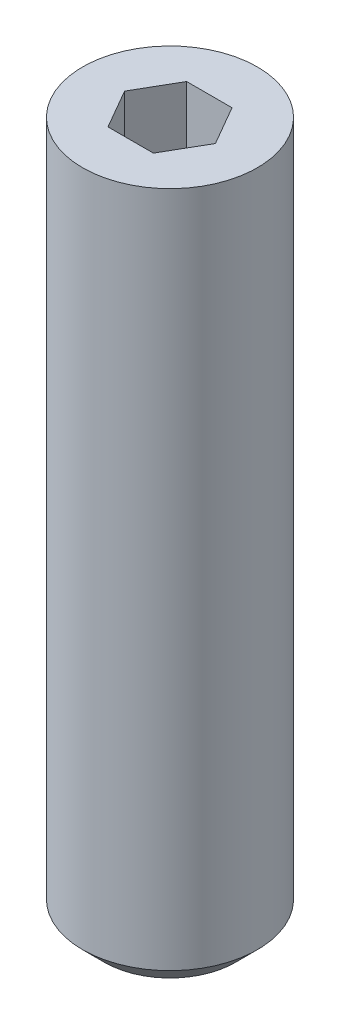
ISO-10303-21;
HEADER;
FILE_DESCRIPTION(('STEP AP214'),'2;1');
FILE_NAME('part.step','',(''),(''),'','','');
FILE_SCHEMA(('AUTOMOTIVE_DESIGN { 1 0 10303 214 1 1 1 1 }'));
ENDSEC;
DATA;
#1=APPLICATION_CONTEXT('core data for automotive mechanical design processes');
#2=APPLICATION_PROTOCOL_DEFINITION('international standard','automotive_design',2000,#1);
#3=PRODUCT_CONTEXT('',#1,'mechanical');
#4=PRODUCT('Part','Part','',(#3));
#5=PRODUCT_RELATED_PRODUCT_CATEGORY('part','',(#4));
#6=PRODUCT_DEFINITION_FORMATION('','',#4);
#7=PRODUCT_DEFINITION_CONTEXT('part definition',#1,'design');
#8=PRODUCT_DEFINITION('design','',#6,#7);
#9=PRODUCT_DEFINITION_SHAPE('','',#8);
#10=(LENGTH_UNIT() NAMED_UNIT(*) SI_UNIT(.MILLI.,.METRE.));
#11=(NAMED_UNIT(*) PLANE_ANGLE_UNIT() SI_UNIT($,.RADIAN.));
#12=(NAMED_UNIT(*) SI_UNIT($,.STERADIAN.) SOLID_ANGLE_UNIT());
#13=UNCERTAINTY_MEASURE_WITH_UNIT(LENGTH_MEASURE(1.E-05),#10,'distance_accuracy_value','');
#14=(GEOMETRIC_REPRESENTATION_CONTEXT(3) GLOBAL_UNCERTAINTY_ASSIGNED_CONTEXT((#13)) GLOBAL_UNIT_ASSIGNED_CONTEXT((#10,
#11,#12)) REPRESENTATION_CONTEXT('',''));
#15=CARTESIAN_POINT('',(0.,0.,0.));
#16=DIRECTION('',(0.,0.,1.));
#17=DIRECTION('',(1.,0.,0.));
#18=AXIS2_PLACEMENT_3D('',#15,#16,#17);
#19=CARTESIAN_POINT('',(0.,8.,0.));
#20=DIRECTION('',(0.,-1.,0.));
#21=DIRECTION('',(0.,0.,-1.));
#22=AXIS2_PLACEMENT_3D('',#19,#20,#21);
#23=CYLINDRICAL_SURFACE('',#22,1.);
#24=CARTESIAN_POINT('',(0.,0.250000000000001,0.));
#25=DIRECTION('',(0.,1.,0.));
#26=DIRECTION('',(0.,0.,1.));
#27=AXIS2_PLACEMENT_3D('',#24,#25,#26);
#28=CIRCLE('',#27,1.);
#29=CARTESIAN_POINT('',(0.,0.250000000000001,1.));
#30=VERTEX_POINT('',#29);
#31=EDGE_CURVE('E48',#30,#30,#28,.T.);
#32=ORIENTED_EDGE('',*,*,#31,.T.);
#33=EDGE_LOOP('',(#32));
#34=FACE_BOUND('',#33,.T.);
#35=CARTESIAN_POINT('',(0.,8.,0.));
#36=DIRECTION('',(0.,1.,0.));
#37=DIRECTION('',(0.,0.,1.));
#38=AXIS2_PLACEMENT_3D('',#35,#36,#37);
#39=CIRCLE('',#38,1.);
#40=CARTESIAN_POINT('',(0.,8.,1.));
#41=VERTEX_POINT('',#40);
#42=EDGE_CURVE('E154',#41,#41,#39,.T.);
#43=ORIENTED_EDGE('',*,*,#42,.F.);
#44=EDGE_LOOP('',(#43));
#45=FACE_BOUND('',#44,.T.);
#46=ADVANCED_FACE('F39',(#34,#45),#23,.T.);
#47=CARTESIAN_POINT('',(0.,8.,0.));
#48=DIRECTION('',(0.,1.,0.));
#49=DIRECTION('',(0.,0.,1.));
#50=AXIS2_PLACEMENT_3D('',#47,#48,#49);
#51=PLANE('',#50);
#52=DIRECTION('',(1.,0.,0.));
#53=VECTOR('',#52,1.);
#54=CARTESIAN_POINT('',(-0.259807621135332,8.,0.45));
#55=LINE('',#54,#53);
#56=CARTESIAN_POINT('',(-0.259807621135332,8.,0.45));
#57=VERTEX_POINT('',#56);
#58=CARTESIAN_POINT('',(0.259807621135331,8.,0.45));
#59=VERTEX_POINT('',#58);
#60=EDGE_CURVE('E55',#57,#59,#55,.T.);
#61=ORIENTED_EDGE('',*,*,#60,.F.);
#62=DIRECTION('',(0.5,0.,0.866025403784438));
#63=VECTOR('',#62,1.);
#64=CARTESIAN_POINT('',(-0.519615242270663,8.,0.));
#65=LINE('',#64,#63);
#66=CARTESIAN_POINT('',(-0.519615242270663,8.,0.));
#67=VERTEX_POINT('',#66);
#68=EDGE_CURVE('E148',#67,#57,#65,.T.);
#69=ORIENTED_EDGE('',*,*,#68,.F.);
#70=DIRECTION('',(-0.5,0.,0.866025403784439));
#71=VECTOR('',#70,1.);
#72=CARTESIAN_POINT('',(-0.259807621135332,8.,-0.45));
#73=LINE('',#72,#71);
#74=CARTESIAN_POINT('',(-0.259807621135332,8.,-0.45));
#75=VERTEX_POINT('',#74);
#76=EDGE_CURVE('E145',#75,#67,#73,.T.);
#77=ORIENTED_EDGE('',*,*,#76,.F.);
#78=DIRECTION('',(-1.,0.,0.));
#79=VECTOR('',#78,1.);
#80=CARTESIAN_POINT('',(0.259807621135331,8.,-0.45));
#81=LINE('',#80,#79);
#82=CARTESIAN_POINT('',(0.259807621135331,8.,-0.45));
#83=VERTEX_POINT('',#82);
#84=EDGE_CURVE('E103',#83,#75,#81,.T.);
#85=ORIENTED_EDGE('',*,*,#84,.F.);
#86=DIRECTION('',(-0.5,0.,-0.866025403784438));
#87=VECTOR('',#86,1.);
#88=CARTESIAN_POINT('',(0.519615242270663,8.,0.));
#89=LINE('',#88,#87);
#90=CARTESIAN_POINT('',(0.519615242270663,8.,0.));
#91=VERTEX_POINT('',#90);
#92=EDGE_CURVE('E139',#91,#83,#89,.T.);
#93=ORIENTED_EDGE('',*,*,#92,.F.);
#94=DIRECTION('',(0.5,0.,-0.866025403784438));
#95=VECTOR('',#94,1.);
#96=CARTESIAN_POINT('',(0.259807621135331,8.,0.45));
#97=LINE('',#96,#95);
#98=EDGE_CURVE('E135',#59,#91,#97,.T.);
#99=ORIENTED_EDGE('',*,*,#98,.F.);
#100=EDGE_LOOP('',(#61,#69,#77,#85,#93,#99));
#101=FACE_BOUND('',#100,.T.);
#102=ORIENTED_EDGE('',*,*,#42,.T.);
#103=EDGE_LOOP('',(#102));
#104=FACE_BOUND('',#103,.T.);
#105=ADVANCED_FACE('F182',(#101,#104),#51,.T.);
#106=CARTESIAN_POINT('',(0.,0.,0.));
#107=DIRECTION('',(0.,1.,0.));
#108=DIRECTION('',(0.,0.,1.));
#109=AXIS2_PLACEMENT_3D('',#106,#107,#108);
#110=PLANE('',#109);
#111=CARTESIAN_POINT('',(0.,0.,0.));
#112=DIRECTION('',(0.,1.,0.));
#113=DIRECTION('',(0.,0.,1.));
#114=AXIS2_PLACEMENT_3D('',#111,#112,#113);
#115=CIRCLE('',#114,0.749999999999997);
#116=CARTESIAN_POINT('',(0.,0.,0.749999999999997));
#117=VERTEX_POINT('',#116);
#118=EDGE_CURVE('E11',#117,#117,#115,.F.);
#119=ORIENTED_EDGE('',*,*,#118,.T.);
#120=EDGE_LOOP('',(#119));
#121=FACE_BOUND('',#120,.T.);
#122=ADVANCED_FACE('F174',(#121),#110,.F.);
#123=CARTESIAN_POINT('',(0.,0.250000000000001,0.));
#124=DIRECTION('',(0.,1.,0.));
#125=DIRECTION('',(0.,0.,1.));
#126=AXIS2_PLACEMENT_3D('',#123,#124,#125);
#127=CONICAL_SURFACE('',#126,1.,0.785398163397452);
#128=ORIENTED_EDGE('',*,*,#118,.F.);
#129=EDGE_LOOP('',(#128));
#130=FACE_BOUND('',#129,.T.);
#131=ORIENTED_EDGE('',*,*,#31,.F.);
#132=EDGE_LOOP('',(#131));
#133=FACE_BOUND('',#132,.T.);
#134=ADVANCED_FACE('F41',(#130,#133),#127,.T.);
#135=CARTESIAN_POINT('',(-0.259807621135332,7.2,0.45));
#136=DIRECTION('',(0.,0.,1.));
#137=DIRECTION('',(1.,0.,0.));
#138=AXIS2_PLACEMENT_3D('',#135,#136,#137);
#139=PLANE('',#138);
#140=ORIENTED_EDGE('',*,*,#60,.T.);
#141=DIRECTION('',(0.,1.,0.));
#142=VECTOR('',#141,1.);
#143=CARTESIAN_POINT('',(0.259807621135331,7.2,0.45));
#144=LINE('',#143,#142);
#145=CARTESIAN_POINT('',(0.259807621135331,7.2,0.45));
#146=VERTEX_POINT('',#145);
#147=EDGE_CURVE('E85',#146,#59,#144,.T.);
#148=ORIENTED_EDGE('',*,*,#147,.F.);
#149=DIRECTION('',(1.,0.,0.));
#150=VECTOR('',#149,1.);
#151=CARTESIAN_POINT('',(-0.259807621135332,7.2,0.45));
#152=LINE('',#151,#150);
#153=CARTESIAN_POINT('',(-0.259807621135332,7.2,0.45));
#154=VERTEX_POINT('',#153);
#155=EDGE_CURVE('E151',#154,#146,#152,.T.);
#156=ORIENTED_EDGE('',*,*,#155,.F.);
#157=DIRECTION('',(0.,1.,0.));
#158=VECTOR('',#157,1.);
#159=CARTESIAN_POINT('',(-0.259807621135332,7.2,0.45));
#160=LINE('',#159,#158);
#161=EDGE_CURVE('E63',#154,#57,#160,.T.);
#162=ORIENTED_EDGE('',*,*,#161,.T.);
#163=EDGE_LOOP('',(#140,#148,#156,#162));
#164=FACE_BOUND('',#163,.T.);
#165=ADVANCED_FACE('F173',(#164),#139,.F.);
#166=CARTESIAN_POINT('',(-0.519615242270663,7.2,0.));
#167=DIRECTION('',(-0.866025403784438,0.,0.5));
#168=DIRECTION('',(0.5,0.,0.866025403784439));
#169=AXIS2_PLACEMENT_3D('',#166,#167,#168);
#170=PLANE('',#169);
#171=ORIENTED_EDGE('',*,*,#68,.T.);
#172=ORIENTED_EDGE('',*,*,#161,.F.);
#173=DIRECTION('',(0.5,0.,0.866025403784438));
#174=VECTOR('',#173,1.);
#175=CARTESIAN_POINT('',(-0.519615242270663,7.2,0.));
#176=LINE('',#175,#174);
#177=CARTESIAN_POINT('',(-0.519615242270663,7.2,0.));
#178=VERTEX_POINT('',#177);
#179=EDGE_CURVE('E117',#178,#154,#176,.T.);
#180=ORIENTED_EDGE('',*,*,#179,.F.);
#181=DIRECTION('',(0.,1.,0.));
#182=VECTOR('',#181,1.);
#183=CARTESIAN_POINT('',(-0.519615242270663,7.2,0.));
#184=LINE('',#183,#182);
#185=EDGE_CURVE('E108',#178,#67,#184,.T.);
#186=ORIENTED_EDGE('',*,*,#185,.T.);
#187=EDGE_LOOP('',(#171,#172,#180,#186));
#188=FACE_BOUND('',#187,.T.);
#189=ADVANCED_FACE('F180',(#188),#170,.F.);
#190=CARTESIAN_POINT('',(-0.259807621135332,7.2,-0.45));
#191=DIRECTION('',(-0.866025403784439,0.,-0.5));
#192=DIRECTION('',(-0.5,0.,0.866025403784439));
#193=AXIS2_PLACEMENT_3D('',#190,#191,#192);
#194=PLANE('',#193);
#195=ORIENTED_EDGE('',*,*,#76,.T.);
#196=ORIENTED_EDGE('',*,*,#185,.F.);
#197=DIRECTION('',(-0.5,0.,0.866025403784439));
#198=VECTOR('',#197,1.);
#199=CARTESIAN_POINT('',(-0.259807621135332,7.2,-0.45));
#200=LINE('',#199,#198);
#201=CARTESIAN_POINT('',(-0.259807621135332,7.2,-0.45));
#202=VERTEX_POINT('',#201);
#203=EDGE_CURVE('E112',#202,#178,#200,.T.);
#204=ORIENTED_EDGE('',*,*,#203,.F.);
#205=DIRECTION('',(0.,1.,0.));
#206=VECTOR('',#205,1.);
#207=CARTESIAN_POINT('',(-0.259807621135332,7.2,-0.45));
#208=LINE('',#207,#206);
#209=EDGE_CURVE('E96',#202,#75,#208,.T.);
#210=ORIENTED_EDGE('',*,*,#209,.T.);
#211=EDGE_LOOP('',(#195,#196,#204,#210));
#212=FACE_BOUND('',#211,.T.);
#213=ADVANCED_FACE('F113',(#212),#194,.F.);
#214=CARTESIAN_POINT('',(0.259807621135331,7.2,-0.45));
#215=DIRECTION('',(0.,0.,-1.));
#216=DIRECTION('',(-1.,0.,0.));
#217=AXIS2_PLACEMENT_3D('',#214,#215,#216);
#218=PLANE('',#217);
#219=ORIENTED_EDGE('',*,*,#84,.T.);
#220=ORIENTED_EDGE('',*,*,#209,.F.);
#221=DIRECTION('',(-1.,0.,0.));
#222=VECTOR('',#221,1.);
#223=CARTESIAN_POINT('',(0.259807621135331,7.2,-0.45));
#224=LINE('',#223,#222);
#225=CARTESIAN_POINT('',(0.259807621135331,7.2,-0.45));
#226=VERTEX_POINT('',#225);
#227=EDGE_CURVE('E100',#226,#202,#224,.T.);
#228=ORIENTED_EDGE('',*,*,#227,.F.);
#229=DIRECTION('',(0.,1.,0.));
#230=VECTOR('',#229,1.);
#231=CARTESIAN_POINT('',(0.259807621135331,7.2,-0.45));
#232=LINE('',#231,#230);
#233=EDGE_CURVE('E109',#226,#83,#232,.T.);
#234=ORIENTED_EDGE('',*,*,#233,.T.);
#235=EDGE_LOOP('',(#219,#220,#228,#234));
#236=FACE_BOUND('',#235,.T.);
#237=ADVANCED_FACE('F98',(#236),#218,.F.);
#238=CARTESIAN_POINT('',(0.519615242270663,7.2,0.));
#239=DIRECTION('',(0.866025403784438,0.,-0.5));
#240=DIRECTION('',(-0.5,0.,-0.866025403784439));
#241=AXIS2_PLACEMENT_3D('',#238,#239,#240);
#242=PLANE('',#241);
#243=ORIENTED_EDGE('',*,*,#92,.T.);
#244=ORIENTED_EDGE('',*,*,#233,.F.);
#245=DIRECTION('',(-0.5,0.,-0.866025403784438));
#246=VECTOR('',#245,1.);
#247=CARTESIAN_POINT('',(0.519615242270663,7.2,0.));
#248=LINE('',#247,#246);
#249=CARTESIAN_POINT('',(0.519615242270663,7.2,0.));
#250=VERTEX_POINT('',#249);
#251=EDGE_CURVE('E123',#250,#226,#248,.T.);
#252=ORIENTED_EDGE('',*,*,#251,.F.);
#253=DIRECTION('',(0.,1.,0.));
#254=VECTOR('',#253,1.);
#255=CARTESIAN_POINT('',(0.519615242270663,7.2,0.));
#256=LINE('',#255,#254);
#257=EDGE_CURVE('E159',#250,#91,#256,.T.);
#258=ORIENTED_EDGE('',*,*,#257,.T.);
#259=EDGE_LOOP('',(#243,#244,#252,#258));
#260=FACE_BOUND('',#259,.T.);
#261=ADVANCED_FACE('F196',(#260),#242,.F.);
#262=CARTESIAN_POINT('',(0.259807621135331,7.2,0.45));
#263=DIRECTION('',(0.866025403784438,0.,0.5));
#264=DIRECTION('',(0.5,0.,-0.866025403784439));
#265=AXIS2_PLACEMENT_3D('',#262,#263,#264);
#266=PLANE('',#265);
#267=ORIENTED_EDGE('',*,*,#98,.T.);
#268=ORIENTED_EDGE('',*,*,#257,.F.);
#269=DIRECTION('',(0.5,0.,-0.866025403784438));
#270=VECTOR('',#269,1.);
#271=CARTESIAN_POINT('',(0.259807621135331,7.2,0.45));
#272=LINE('',#271,#270);
#273=EDGE_CURVE('E127',#146,#250,#272,.T.);
#274=ORIENTED_EDGE('',*,*,#273,.F.);
#275=ORIENTED_EDGE('',*,*,#147,.T.);
#276=EDGE_LOOP('',(#267,#268,#274,#275));
#277=FACE_BOUND('',#276,.T.);
#278=ADVANCED_FACE('F193',(#277),#266,.F.);
#279=CARTESIAN_POINT('',(0.,7.2,0.));
#280=DIRECTION('',(0.,1.,0.));
#281=DIRECTION('',(0.,0.,1.));
#282=AXIS2_PLACEMENT_3D('',#279,#280,#281);
#283=PLANE('',#282);
#284=ORIENTED_EDGE('',*,*,#155,.T.);
#285=ORIENTED_EDGE('',*,*,#273,.T.);
#286=ORIENTED_EDGE('',*,*,#251,.T.);
#287=ORIENTED_EDGE('',*,*,#227,.T.);
#288=ORIENTED_EDGE('',*,*,#203,.T.);
#289=ORIENTED_EDGE('',*,*,#179,.T.);
#290=EDGE_LOOP('',(#284,#285,#286,#287,#288,#289));
#291=FACE_BOUND('',#290,.T.);
#292=ADVANCED_FACE('F120',(#291),#283,.T.);
#293=CLOSED_SHELL('',(#46,#105,#122,#134,#165,#189,#213,#237,#261,#278,#292));
#294=MANIFOLD_SOLID_BREP('B2',#293);
#295=ADVANCED_BREP_SHAPE_REPRESENTATION('',(#18,#294),#14);
#296=SHAPE_DEFINITION_REPRESENTATION(#9,#295);
ENDSEC;
END-ISO-10303-21;
